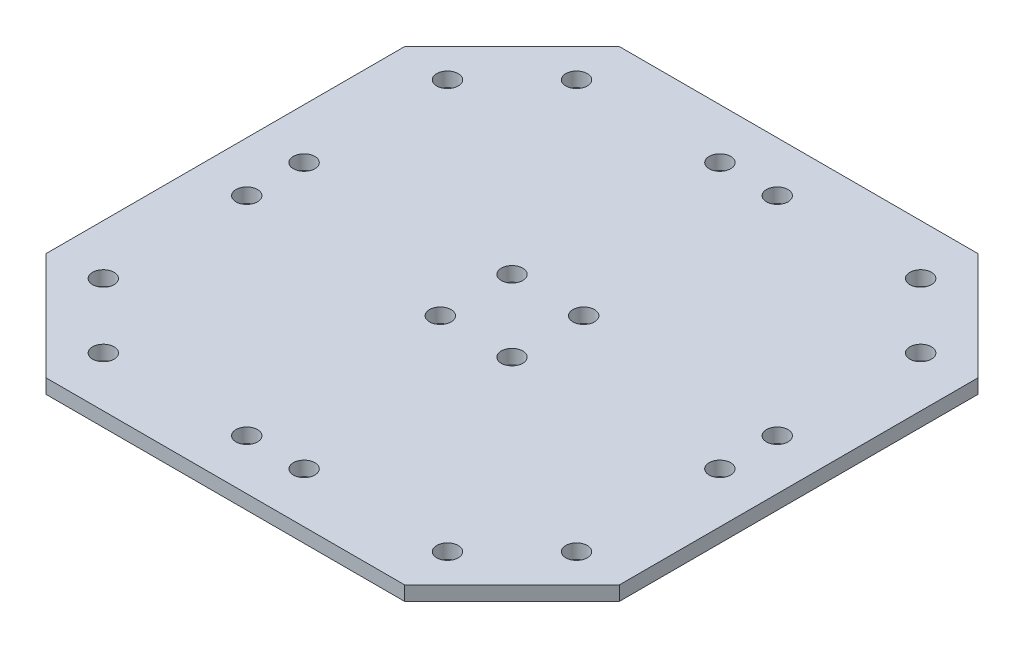
ISO-10303-21;
HEADER;
FILE_DESCRIPTION(('STEP AP214'),'2;1');
FILE_NAME('part.step','',(''),(''),'','','');
FILE_SCHEMA(('AUTOMOTIVE_DESIGN { 1 0 10303 214 1 1 1 1 }'));
ENDSEC;
DATA;
#1=APPLICATION_CONTEXT('core data for automotive mechanical design processes');
#2=APPLICATION_PROTOCOL_DEFINITION('international standard','automotive_design',2000,#1);
#3=PRODUCT_CONTEXT('',#1,'mechanical');
#4=PRODUCT('Part','Part','',(#3));
#5=PRODUCT_RELATED_PRODUCT_CATEGORY('part','',(#4));
#6=PRODUCT_DEFINITION_FORMATION('','',#4);
#7=PRODUCT_DEFINITION_CONTEXT('part definition',#1,'design');
#8=PRODUCT_DEFINITION('design','',#6,#7);
#9=PRODUCT_DEFINITION_SHAPE('','',#8);
#10=(LENGTH_UNIT() NAMED_UNIT(*) SI_UNIT(.MILLI.,.METRE.));
#11=(NAMED_UNIT(*) PLANE_ANGLE_UNIT() SI_UNIT($,.RADIAN.));
#12=(NAMED_UNIT(*) SI_UNIT($,.STERADIAN.) SOLID_ANGLE_UNIT());
#13=UNCERTAINTY_MEASURE_WITH_UNIT(LENGTH_MEASURE(1.E-05),#10,'distance_accuracy_value','');
#14=(GEOMETRIC_REPRESENTATION_CONTEXT(3) GLOBAL_UNCERTAINTY_ASSIGNED_CONTEXT((#13)) GLOBAL_UNIT_ASSIGNED_CONTEXT((#10,
#11,#12)) REPRESENTATION_CONTEXT('',''));
#15=CARTESIAN_POINT('',(0.,0.,0.));
#16=DIRECTION('',(0.,0.,1.));
#17=DIRECTION('',(1.,0.,0.));
#18=AXIS2_PLACEMENT_3D('',#15,#16,#17);
#19=CARTESIAN_POINT('',(32.5,2.,-32.5));
#20=DIRECTION('',(0.707106781186547,0.,-0.707106781186548));
#21=DIRECTION('',(-0.707106781186548,0.,-0.707106781186547));
#22=AXIS2_PLACEMENT_3D('',#19,#20,#21);
#23=PLANE('',#22);
#24=DIRECTION('',(0.707106781186548,0.,0.707106781186547));
#25=VECTOR('',#24,1.);
#26=CARTESIAN_POINT('',(32.5,0.,-32.5));
#27=LINE('',#26,#25);
#28=CARTESIAN_POINT('',(25.,0.,-40.));
#29=VERTEX_POINT('',#28);
#30=CARTESIAN_POINT('',(40.,0.,-25.));
#31=VERTEX_POINT('',#30);
#32=EDGE_CURVE('E152',#29,#31,#27,.T.);
#33=ORIENTED_EDGE('',*,*,#32,.F.);
#34=DIRECTION('',(0.,-1.,0.));
#35=VECTOR('',#34,1.);
#36=CARTESIAN_POINT('',(25.,2.,-40.));
#37=LINE('',#36,#35);
#38=CARTESIAN_POINT('',(25.,2.,-40.));
#39=VERTEX_POINT('',#38);
#40=EDGE_CURVE('E11',#39,#29,#37,.T.);
#41=ORIENTED_EDGE('',*,*,#40,.F.);
#42=DIRECTION('',(0.707106781186548,0.,0.707106781186547));
#43=VECTOR('',#42,1.);
#44=CARTESIAN_POINT('',(32.5,2.,-32.5));
#45=LINE('',#44,#43);
#46=CARTESIAN_POINT('',(40.,2.,-25.));
#47=VERTEX_POINT('',#46);
#48=EDGE_CURVE('E153',#39,#47,#45,.T.);
#49=ORIENTED_EDGE('',*,*,#48,.T.);
#50=DIRECTION('',(0.,-1.,0.));
#51=VECTOR('',#50,1.);
#52=CARTESIAN_POINT('',(40.,2.,-25.));
#53=LINE('',#52,#51);
#54=EDGE_CURVE('E49',#47,#31,#53,.T.);
#55=ORIENTED_EDGE('',*,*,#54,.T.);
#56=EDGE_LOOP('',(#33,#41,#49,#55));
#57=FACE_BOUND('',#56,.T.);
#58=ADVANCED_FACE('F41',(#57),#23,.T.);
#59=CARTESIAN_POINT('',(0.,2.,-40.));
#60=DIRECTION('',(0.,0.,-1.));
#61=DIRECTION('',(-1.,0.,0.));
#62=AXIS2_PLACEMENT_3D('',#59,#60,#61);
#63=PLANE('',#62);
#64=DIRECTION('',(1.,0.,0.));
#65=VECTOR('',#64,1.);
#66=CARTESIAN_POINT('',(0.,0.,-40.));
#67=LINE('',#66,#65);
#68=CARTESIAN_POINT('',(-25.,0.,-40.));
#69=VERTEX_POINT('',#68);
#70=EDGE_CURVE('E160',#69,#29,#67,.T.);
#71=ORIENTED_EDGE('',*,*,#70,.F.);
#72=DIRECTION('',(0.,-1.,0.));
#73=VECTOR('',#72,1.);
#74=CARTESIAN_POINT('',(-25.,2.,-40.));
#75=LINE('',#74,#73);
#76=CARTESIAN_POINT('',(-25.,2.,-40.));
#77=VERTEX_POINT('',#76);
#78=EDGE_CURVE('E116',#77,#69,#75,.T.);
#79=ORIENTED_EDGE('',*,*,#78,.F.);
#80=DIRECTION('',(1.,0.,0.));
#81=VECTOR('',#80,1.);
#82=CARTESIAN_POINT('',(0.,2.,-40.));
#83=LINE('',#82,#81);
#84=EDGE_CURVE('E156',#77,#39,#83,.T.);
#85=ORIENTED_EDGE('',*,*,#84,.T.);
#86=ORIENTED_EDGE('',*,*,#40,.T.);
#87=EDGE_LOOP('',(#71,#79,#85,#86));
#88=FACE_BOUND('',#87,.T.);
#89=ADVANCED_FACE('F173',(#88),#63,.T.);
#90=CARTESIAN_POINT('',(40.,2.,0.));
#91=DIRECTION('',(-1.,0.,0.));
#92=DIRECTION('',(0.,0.,1.));
#93=AXIS2_PLACEMENT_3D('',#90,#91,#92);
#94=PLANE('',#93);
#95=DIRECTION('',(0.,0.,-1.));
#96=VECTOR('',#95,1.);
#97=CARTESIAN_POINT('',(40.,0.,0.));
#98=LINE('',#97,#96);
#99=CARTESIAN_POINT('',(40.,0.,25.));
#100=VERTEX_POINT('',#99);
#101=EDGE_CURVE('E111',#100,#31,#98,.T.);
#102=ORIENTED_EDGE('',*,*,#101,.T.);
#103=ORIENTED_EDGE('',*,*,#54,.F.);
#104=DIRECTION('',(0.,0.,-1.));
#105=VECTOR('',#104,1.);
#106=CARTESIAN_POINT('',(40.,2.,0.));
#107=LINE('',#106,#105);
#108=CARTESIAN_POINT('',(40.,2.,25.));
#109=VERTEX_POINT('',#108);
#110=EDGE_CURVE('E57',#109,#47,#107,.T.);
#111=ORIENTED_EDGE('',*,*,#110,.F.);
#112=DIRECTION('',(0.,-1.,0.));
#113=VECTOR('',#112,1.);
#114=CARTESIAN_POINT('',(40.,2.,25.));
#115=LINE('',#114,#113);
#116=EDGE_CURVE('E106',#109,#100,#115,.T.);
#117=ORIENTED_EDGE('',*,*,#116,.T.);
#118=EDGE_LOOP('',(#102,#103,#111,#117));
#119=FACE_BOUND('',#118,.T.);
#120=ADVANCED_FACE('F165',(#119),#94,.F.);
#121=CARTESIAN_POINT('',(0.,2.,0.));
#122=DIRECTION('',(0.,1.,0.));
#123=DIRECTION('',(0.,0.,1.));
#124=AXIS2_PLACEMENT_3D('',#121,#122,#123);
#125=PLANE('',#124);
#126=CARTESIAN_POINT('',(-5.,2.,5.));
#127=DIRECTION('',(0.,1.,0.));
#128=DIRECTION('',(0.,0.,1.));
#129=AXIS2_PLACEMENT_3D('',#126,#127,#128);
#130=CIRCLE('',#129,1.5);
#131=CARTESIAN_POINT('',(-5.,2.,6.5));
#132=VERTEX_POINT('',#131);
#133=EDGE_CURVE('E594',#132,#132,#130,.T.);
#134=ORIENTED_EDGE('',*,*,#133,.F.);
#135=EDGE_LOOP('',(#134));
#136=FACE_BOUND('',#135,.T.);
#137=CARTESIAN_POINT('',(-33.,2.,4.));
#138=DIRECTION('',(0.,1.,0.));
#139=DIRECTION('',(0.,0.,1.));
#140=AXIS2_PLACEMENT_3D('',#137,#138,#139);
#141=CIRCLE('',#140,1.50000000000001);
#142=CARTESIAN_POINT('',(-33.,2.,5.50000000000001));
#143=VERTEX_POINT('',#142);
#144=EDGE_CURVE('E618',#143,#143,#141,.T.);
#145=ORIENTED_EDGE('',*,*,#144,.F.);
#146=EDGE_LOOP('',(#145));
#147=FACE_BOUND('',#146,.T.);
#148=CARTESIAN_POINT('',(-4.,2.,33.));
#149=DIRECTION('',(0.,1.,0.));
#150=DIRECTION('',(0.,0.,1.));
#151=AXIS2_PLACEMENT_3D('',#148,#149,#150);
#152=CIRCLE('',#151,1.5);
#153=CARTESIAN_POINT('',(-4.,2.,34.5));
#154=VERTEX_POINT('',#153);
#155=EDGE_CURVE('E615',#154,#154,#152,.T.);
#156=ORIENTED_EDGE('',*,*,#155,.F.);
#157=EDGE_LOOP('',(#156));
#158=FACE_BOUND('',#157,.T.);
#159=CARTESIAN_POINT('',(-24.,2.,33.));
#160=DIRECTION('',(0.,1.,0.));
#161=DIRECTION('',(0.,0.,1.));
#162=AXIS2_PLACEMENT_3D('',#159,#160,#161);
#163=CIRCLE('',#162,1.5);
#164=CARTESIAN_POINT('',(-24.,2.,34.5));
#165=VERTEX_POINT('',#164);
#166=EDGE_CURVE('E612',#165,#165,#163,.T.);
#167=ORIENTED_EDGE('',*,*,#166,.F.);
#168=EDGE_LOOP('',(#167));
#169=FACE_BOUND('',#168,.T.);
#170=CARTESIAN_POINT('',(-33.,2.,24.));
#171=DIRECTION('',(0.,1.,0.));
#172=DIRECTION('',(0.,0.,1.));
#173=AXIS2_PLACEMENT_3D('',#170,#171,#172);
#174=CIRCLE('',#173,1.50000000000001);
#175=CARTESIAN_POINT('',(-33.,2.,25.5));
#176=VERTEX_POINT('',#175);
#177=EDGE_CURVE('E608',#176,#176,#174,.T.);
#178=ORIENTED_EDGE('',*,*,#177,.F.);
#179=EDGE_LOOP('',(#178));
#180=FACE_BOUND('',#179,.T.);
#181=CARTESIAN_POINT('',(-5.,2.,-5.));
#182=DIRECTION('',(0.,1.,0.));
#183=DIRECTION('',(0.,0.,1.));
#184=AXIS2_PLACEMENT_3D('',#181,#182,#183);
#185=CIRCLE('',#184,1.5);
#186=CARTESIAN_POINT('',(-5.,2.,-3.5));
#187=VERTEX_POINT('',#186);
#188=EDGE_CURVE('E649',#187,#187,#185,.F.);
#189=ORIENTED_EDGE('',*,*,#188,.T.);
#190=EDGE_LOOP('',(#189));
#191=FACE_BOUND('',#190,.T.);
#192=CARTESIAN_POINT('',(-33.,2.,-4.));
#193=DIRECTION('',(0.,1.,0.));
#194=DIRECTION('',(0.,0.,1.));
#195=AXIS2_PLACEMENT_3D('',#192,#193,#194);
#196=CIRCLE('',#195,1.50000000000001);
#197=CARTESIAN_POINT('',(-33.,2.,-2.49999999999999));
#198=VERTEX_POINT('',#197);
#199=EDGE_CURVE('E646',#198,#198,#196,.F.);
#200=ORIENTED_EDGE('',*,*,#199,.T.);
#201=EDGE_LOOP('',(#200));
#202=FACE_BOUND('',#201,.T.);
#203=CARTESIAN_POINT('',(-4.,2.,-33.));
#204=DIRECTION('',(0.,1.,0.));
#205=DIRECTION('',(0.,0.,1.));
#206=AXIS2_PLACEMENT_3D('',#203,#204,#205);
#207=CIRCLE('',#206,1.5);
#208=CARTESIAN_POINT('',(-4.,2.,-31.5));
#209=VERTEX_POINT('',#208);
#210=EDGE_CURVE('E643',#209,#209,#207,.F.);
#211=ORIENTED_EDGE('',*,*,#210,.T.);
#212=EDGE_LOOP('',(#211));
#213=FACE_BOUND('',#212,.T.);
#214=CARTESIAN_POINT('',(-24.,2.,-33.));
#215=DIRECTION('',(0.,1.,0.));
#216=DIRECTION('',(0.,0.,1.));
#217=AXIS2_PLACEMENT_3D('',#214,#215,#216);
#218=CIRCLE('',#217,1.5);
#219=CARTESIAN_POINT('',(-24.,2.,-31.5));
#220=VERTEX_POINT('',#219);
#221=EDGE_CURVE('E640',#220,#220,#218,.F.);
#222=ORIENTED_EDGE('',*,*,#221,.T.);
#223=EDGE_LOOP('',(#222));
#224=FACE_BOUND('',#223,.T.);
#225=CARTESIAN_POINT('',(-33.,2.,-24.));
#226=DIRECTION('',(0.,1.,0.));
#227=DIRECTION('',(0.,0.,1.));
#228=AXIS2_PLACEMENT_3D('',#225,#226,#227);
#229=CIRCLE('',#228,1.50000000000001);
#230=CARTESIAN_POINT('',(-33.,2.,-22.5));
#231=VERTEX_POINT('',#230);
#232=EDGE_CURVE('E637',#231,#231,#229,.F.);
#233=ORIENTED_EDGE('',*,*,#232,.T.);
#234=EDGE_LOOP('',(#233));
#235=FACE_BOUND('',#234,.T.);
#236=CARTESIAN_POINT('',(5.,2.,5.));
#237=DIRECTION('',(0.,1.,0.));
#238=DIRECTION('',(0.,0.,1.));
#239=AXIS2_PLACEMENT_3D('',#236,#237,#238);
#240=CIRCLE('',#239,1.5);
#241=CARTESIAN_POINT('',(5.,2.,6.5));
#242=VERTEX_POINT('',#241);
#243=EDGE_CURVE('E679',#242,#242,#240,.F.);
#244=ORIENTED_EDGE('',*,*,#243,.T.);
#245=EDGE_LOOP('',(#244));
#246=FACE_BOUND('',#245,.T.);
#247=CARTESIAN_POINT('',(33.,2.,4.));
#248=DIRECTION('',(0.,1.,0.));
#249=DIRECTION('',(0.,0.,1.));
#250=AXIS2_PLACEMENT_3D('',#247,#248,#249);
#251=CIRCLE('',#250,1.50000000000001);
#252=CARTESIAN_POINT('',(33.,2.,5.50000000000001));
#253=VERTEX_POINT('',#252);
#254=EDGE_CURVE('E676',#253,#253,#251,.F.);
#255=ORIENTED_EDGE('',*,*,#254,.T.);
#256=EDGE_LOOP('',(#255));
#257=FACE_BOUND('',#256,.T.);
#258=CARTESIAN_POINT('',(4.,2.,33.));
#259=DIRECTION('',(0.,1.,0.));
#260=DIRECTION('',(0.,0.,1.));
#261=AXIS2_PLACEMENT_3D('',#258,#259,#260);
#262=CIRCLE('',#261,1.5);
#263=CARTESIAN_POINT('',(4.,2.,34.5));
#264=VERTEX_POINT('',#263);
#265=EDGE_CURVE('E673',#264,#264,#262,.F.);
#266=ORIENTED_EDGE('',*,*,#265,.T.);
#267=EDGE_LOOP('',(#266));
#268=FACE_BOUND('',#267,.T.);
#269=CARTESIAN_POINT('',(24.,2.,33.));
#270=DIRECTION('',(0.,1.,0.));
#271=DIRECTION('',(0.,0.,1.));
#272=AXIS2_PLACEMENT_3D('',#269,#270,#271);
#273=CIRCLE('',#272,1.5);
#274=CARTESIAN_POINT('',(24.,2.,34.5));
#275=VERTEX_POINT('',#274);
#276=EDGE_CURVE('E670',#275,#275,#273,.F.);
#277=ORIENTED_EDGE('',*,*,#276,.T.);
#278=EDGE_LOOP('',(#277));
#279=FACE_BOUND('',#278,.T.);
#280=CARTESIAN_POINT('',(33.,2.,24.));
#281=DIRECTION('',(0.,1.,0.));
#282=DIRECTION('',(0.,0.,1.));
#283=AXIS2_PLACEMENT_3D('',#280,#281,#282);
#284=CIRCLE('',#283,1.50000000000001);
#285=CARTESIAN_POINT('',(33.,2.,25.5));
#286=VERTEX_POINT('',#285);
#287=EDGE_CURVE('E667',#286,#286,#284,.F.);
#288=ORIENTED_EDGE('',*,*,#287,.T.);
#289=EDGE_LOOP('',(#288));
#290=FACE_BOUND('',#289,.T.);
#291=CARTESIAN_POINT('',(5.,2.,-5.));
#292=DIRECTION('',(0.,1.,0.));
#293=DIRECTION('',(0.,0.,1.));
#294=AXIS2_PLACEMENT_3D('',#291,#292,#293);
#295=CIRCLE('',#294,1.5);
#296=CARTESIAN_POINT('',(5.,2.,-3.5));
#297=VERTEX_POINT('',#296);
#298=EDGE_CURVE('E149',#297,#297,#295,.T.);
#299=ORIENTED_EDGE('',*,*,#298,.F.);
#300=EDGE_LOOP('',(#299));
#301=FACE_BOUND('',#300,.T.);
#302=CARTESIAN_POINT('',(33.,2.,-4.));
#303=DIRECTION('',(0.,1.,0.));
#304=DIRECTION('',(0.,0.,1.));
#305=AXIS2_PLACEMENT_3D('',#302,#303,#304);
#306=CIRCLE('',#305,1.50000000000001);
#307=CARTESIAN_POINT('',(33.,2.,-2.49999999999999));
#308=VERTEX_POINT('',#307);
#309=EDGE_CURVE('E146',#308,#308,#306,.T.);
#310=ORIENTED_EDGE('',*,*,#309,.F.);
#311=EDGE_LOOP('',(#310));
#312=FACE_BOUND('',#311,.T.);
#313=CARTESIAN_POINT('',(4.,2.,-33.));
#314=DIRECTION('',(0.,1.,0.));
#315=DIRECTION('',(0.,0.,1.));
#316=AXIS2_PLACEMENT_3D('',#313,#314,#315);
#317=CIRCLE('',#316,1.5);
#318=CARTESIAN_POINT('',(4.,2.,-31.5));
#319=VERTEX_POINT('',#318);
#320=EDGE_CURVE('E143',#319,#319,#317,.T.);
#321=ORIENTED_EDGE('',*,*,#320,.F.);
#322=EDGE_LOOP('',(#321));
#323=FACE_BOUND('',#322,.T.);
#324=CARTESIAN_POINT('',(24.,2.,-33.));
#325=DIRECTION('',(0.,1.,0.));
#326=DIRECTION('',(0.,0.,1.));
#327=AXIS2_PLACEMENT_3D('',#324,#325,#326);
#328=CIRCLE('',#327,1.5);
#329=CARTESIAN_POINT('',(24.,2.,-31.5));
#330=VERTEX_POINT('',#329);
#331=EDGE_CURVE('E140',#330,#330,#328,.T.);
#332=ORIENTED_EDGE('',*,*,#331,.F.);
#333=EDGE_LOOP('',(#332));
#334=FACE_BOUND('',#333,.T.);
#335=CARTESIAN_POINT('',(33.,2.,-24.));
#336=DIRECTION('',(0.,1.,0.));
#337=DIRECTION('',(0.,0.,1.));
#338=AXIS2_PLACEMENT_3D('',#335,#336,#337);
#339=CIRCLE('',#338,1.50000000000001);
#340=CARTESIAN_POINT('',(33.,2.,-22.5));
#341=VERTEX_POINT('',#340);
#342=EDGE_CURVE('E137',#341,#341,#339,.T.);
#343=ORIENTED_EDGE('',*,*,#342,.F.);
#344=EDGE_LOOP('',(#343));
#345=FACE_BOUND('',#344,.T.);
#346=ORIENTED_EDGE('',*,*,#48,.F.);
#347=ORIENTED_EDGE('',*,*,#84,.F.);
#348=DIRECTION('',(-0.707106781186548,0.,0.707106781186547));
#349=VECTOR('',#348,1.);
#350=CARTESIAN_POINT('',(-32.5,2.,-32.5));
#351=LINE('',#350,#349);
#352=CARTESIAN_POINT('',(-40.,2.,-25.));
#353=VERTEX_POINT('',#352);
#354=EDGE_CURVE('E181',#77,#353,#351,.T.);
#355=ORIENTED_EDGE('',*,*,#354,.T.);
#356=DIRECTION('',(0.,0.,-1.));
#357=VECTOR('',#356,1.);
#358=CARTESIAN_POINT('',(-40.,2.,0.));
#359=LINE('',#358,#357);
#360=CARTESIAN_POINT('',(-40.,2.,25.));
#361=VERTEX_POINT('',#360);
#362=EDGE_CURVE('E182',#361,#353,#359,.T.);
#363=ORIENTED_EDGE('',*,*,#362,.F.);
#364=DIRECTION('',(-0.707106781186548,0.,-0.707106781186547));
#365=VECTOR('',#364,1.);
#366=CARTESIAN_POINT('',(-32.5,2.,32.5));
#367=LINE('',#366,#365);
#368=CARTESIAN_POINT('',(-25.,2.,40.));
#369=VERTEX_POINT('',#368);
#370=EDGE_CURVE('E683',#369,#361,#367,.T.);
#371=ORIENTED_EDGE('',*,*,#370,.F.);
#372=DIRECTION('',(1.,0.,0.));
#373=VECTOR('',#372,1.);
#374=CARTESIAN_POINT('',(0.,2.,40.));
#375=LINE('',#374,#373);
#376=CARTESIAN_POINT('',(25.,2.,40.));
#377=VERTEX_POINT('',#376);
#378=EDGE_CURVE('E74',#369,#377,#375,.T.);
#379=ORIENTED_EDGE('',*,*,#378,.T.);
#380=DIRECTION('',(0.707106781186548,0.,-0.707106781186547));
#381=VECTOR('',#380,1.);
#382=CARTESIAN_POINT('',(32.5,2.,32.5));
#383=LINE('',#382,#381);
#384=EDGE_CURVE('E99',#377,#109,#383,.T.);
#385=ORIENTED_EDGE('',*,*,#384,.T.);
#386=ORIENTED_EDGE('',*,*,#110,.T.);
#387=EDGE_LOOP('',(#346,#347,#355,#363,#371,#379,#385,#386));
#388=FACE_BOUND('',#387,.T.);
#389=ADVANCED_FACE('F189',(#136,#147,#158,#169,#180,#191,#202,#213,#224,#235,#246,#257,#268,
#279,#290,#301,#312,#323,#334,#345,#388),#125,.T.);
#390=CARTESIAN_POINT('',(0.,0.,0.));
#391=DIRECTION('',(0.,1.,0.));
#392=DIRECTION('',(0.,0.,1.));
#393=AXIS2_PLACEMENT_3D('',#390,#391,#392);
#394=PLANE('',#393);
#395=CARTESIAN_POINT('',(-5.,0.,5.));
#396=DIRECTION('',(0.,1.,0.));
#397=DIRECTION('',(0.,0.,-1.));
#398=AXIS2_PLACEMENT_3D('',#395,#396,#397);
#399=CIRCLE('',#398,1.5);
#400=CARTESIAN_POINT('',(-5.,0.,3.5));
#401=VERTEX_POINT('',#400);
#402=EDGE_CURVE('E597',#401,#401,#399,.T.);
#403=ORIENTED_EDGE('',*,*,#402,.T.);
#404=EDGE_LOOP('',(#403));
#405=FACE_BOUND('',#404,.T.);
#406=CARTESIAN_POINT('',(-33.,0.,4.));
#407=DIRECTION('',(0.,1.,0.));
#408=DIRECTION('',(0.,0.,-1.));
#409=AXIS2_PLACEMENT_3D('',#406,#407,#408);
#410=CIRCLE('',#409,1.50000000000001);
#411=CARTESIAN_POINT('',(-33.,0.,2.49999999999999));
#412=VERTEX_POINT('',#411);
#413=EDGE_CURVE('E598',#412,#412,#410,.T.);
#414=ORIENTED_EDGE('',*,*,#413,.T.);
#415=EDGE_LOOP('',(#414));
#416=FACE_BOUND('',#415,.T.);
#417=CARTESIAN_POINT('',(-4.,0.,33.));
#418=DIRECTION('',(0.,1.,0.));
#419=DIRECTION('',(0.,0.,-1.));
#420=AXIS2_PLACEMENT_3D('',#417,#418,#419);
#421=CIRCLE('',#420,1.5);
#422=CARTESIAN_POINT('',(-4.,0.,31.5));
#423=VERTEX_POINT('',#422);
#424=EDGE_CURVE('E601',#423,#423,#421,.T.);
#425=ORIENTED_EDGE('',*,*,#424,.T.);
#426=EDGE_LOOP('',(#425));
#427=FACE_BOUND('',#426,.T.);
#428=CARTESIAN_POINT('',(-24.,0.,33.));
#429=DIRECTION('',(0.,1.,0.));
#430=DIRECTION('',(0.,0.,-1.));
#431=AXIS2_PLACEMENT_3D('',#428,#429,#430);
#432=CIRCLE('',#431,1.5);
#433=CARTESIAN_POINT('',(-24.,0.,31.5));
#434=VERTEX_POINT('',#433);
#435=EDGE_CURVE('E609',#434,#434,#432,.T.);
#436=ORIENTED_EDGE('',*,*,#435,.T.);
#437=EDGE_LOOP('',(#436));
#438=FACE_BOUND('',#437,.T.);
#439=CARTESIAN_POINT('',(-33.,0.,24.));
#440=DIRECTION('',(0.,1.,0.));
#441=DIRECTION('',(0.,0.,-1.));
#442=AXIS2_PLACEMENT_3D('',#439,#440,#441);
#443=CIRCLE('',#442,1.50000000000001);
#444=CARTESIAN_POINT('',(-33.,0.,22.5));
#445=VERTEX_POINT('',#444);
#446=EDGE_CURVE('E605',#445,#445,#443,.T.);
#447=ORIENTED_EDGE('',*,*,#446,.T.);
#448=EDGE_LOOP('',(#447));
#449=FACE_BOUND('',#448,.T.);
#450=CARTESIAN_POINT('',(-5.,0.,-5.));
#451=DIRECTION('',(0.,-1.,0.));
#452=DIRECTION('',(0.,0.,1.));
#453=AXIS2_PLACEMENT_3D('',#450,#451,#452);
#454=CIRCLE('',#453,1.5);
#455=CARTESIAN_POINT('',(-5.,0.,-3.5));
#456=VERTEX_POINT('',#455);
#457=EDGE_CURVE('E622',#456,#456,#454,.T.);
#458=ORIENTED_EDGE('',*,*,#457,.F.);
#459=EDGE_LOOP('',(#458));
#460=FACE_BOUND('',#459,.T.);
#461=CARTESIAN_POINT('',(-33.,0.,-4.));
#462=DIRECTION('',(0.,-1.,0.));
#463=DIRECTION('',(0.,0.,1.));
#464=AXIS2_PLACEMENT_3D('',#461,#462,#463);
#465=CIRCLE('',#464,1.50000000000001);
#466=CARTESIAN_POINT('',(-33.,0.,-2.49999999999999));
#467=VERTEX_POINT('',#466);
#468=EDGE_CURVE('E630',#467,#467,#465,.T.);
#469=ORIENTED_EDGE('',*,*,#468,.F.);
#470=EDGE_LOOP('',(#469));
#471=FACE_BOUND('',#470,.T.);
#472=CARTESIAN_POINT('',(-4.,0.,-33.));
#473=DIRECTION('',(0.,-1.,0.));
#474=DIRECTION('',(0.,0.,1.));
#475=AXIS2_PLACEMENT_3D('',#472,#473,#474);
#476=CIRCLE('',#475,1.5);
#477=CARTESIAN_POINT('',(-4.,0.,-31.5));
#478=VERTEX_POINT('',#477);
#479=EDGE_CURVE('E627',#478,#478,#476,.T.);
#480=ORIENTED_EDGE('',*,*,#479,.F.);
#481=EDGE_LOOP('',(#480));
#482=FACE_BOUND('',#481,.T.);
#483=CARTESIAN_POINT('',(-24.,0.,-33.));
#484=DIRECTION('',(0.,-1.,0.));
#485=DIRECTION('',(0.,0.,1.));
#486=AXIS2_PLACEMENT_3D('',#483,#484,#485);
#487=CIRCLE('',#486,1.5);
#488=CARTESIAN_POINT('',(-24.,0.,-31.5));
#489=VERTEX_POINT('',#488);
#490=EDGE_CURVE('E623',#489,#489,#487,.T.);
#491=ORIENTED_EDGE('',*,*,#490,.F.);
#492=EDGE_LOOP('',(#491));
#493=FACE_BOUND('',#492,.T.);
#494=CARTESIAN_POINT('',(-33.,0.,-24.));
#495=DIRECTION('',(0.,-1.,0.));
#496=DIRECTION('',(0.,0.,1.));
#497=AXIS2_PLACEMENT_3D('',#494,#495,#496);
#498=CIRCLE('',#497,1.50000000000001);
#499=CARTESIAN_POINT('',(-33.,0.,-22.5));
#500=VERTEX_POINT('',#499);
#501=EDGE_CURVE('E626',#500,#500,#498,.T.);
#502=ORIENTED_EDGE('',*,*,#501,.F.);
#503=EDGE_LOOP('',(#502));
#504=FACE_BOUND('',#503,.T.);
#505=CARTESIAN_POINT('',(5.,0.,5.));
#506=DIRECTION('',(0.,-1.,0.));
#507=DIRECTION('',(0.,0.,-1.));
#508=AXIS2_PLACEMENT_3D('',#505,#506,#507);
#509=CIRCLE('',#508,1.5);
#510=CARTESIAN_POINT('',(5.,0.,3.5));
#511=VERTEX_POINT('',#510);
#512=EDGE_CURVE('E652',#511,#511,#509,.T.);
#513=ORIENTED_EDGE('',*,*,#512,.F.);
#514=EDGE_LOOP('',(#513));
#515=FACE_BOUND('',#514,.T.);
#516=CARTESIAN_POINT('',(33.,0.,4.));
#517=DIRECTION('',(0.,-1.,0.));
#518=DIRECTION('',(0.,0.,-1.));
#519=AXIS2_PLACEMENT_3D('',#516,#517,#518);
#520=CIRCLE('',#519,1.50000000000001);
#521=CARTESIAN_POINT('',(33.,0.,2.49999999999999));
#522=VERTEX_POINT('',#521);
#523=EDGE_CURVE('E660',#522,#522,#520,.T.);
#524=ORIENTED_EDGE('',*,*,#523,.F.);
#525=EDGE_LOOP('',(#524));
#526=FACE_BOUND('',#525,.T.);
#527=CARTESIAN_POINT('',(4.,0.,33.));
#528=DIRECTION('',(0.,-1.,0.));
#529=DIRECTION('',(0.,0.,-1.));
#530=AXIS2_PLACEMENT_3D('',#527,#528,#529);
#531=CIRCLE('',#530,1.5);
#532=CARTESIAN_POINT('',(4.,0.,31.5));
#533=VERTEX_POINT('',#532);
#534=EDGE_CURVE('E657',#533,#533,#531,.T.);
#535=ORIENTED_EDGE('',*,*,#534,.F.);
#536=EDGE_LOOP('',(#535));
#537=FACE_BOUND('',#536,.T.);
#538=CARTESIAN_POINT('',(24.,0.,33.));
#539=DIRECTION('',(0.,-1.,0.));
#540=DIRECTION('',(0.,0.,-1.));
#541=AXIS2_PLACEMENT_3D('',#538,#539,#540);
#542=CIRCLE('',#541,1.5);
#543=CARTESIAN_POINT('',(24.,0.,31.5));
#544=VERTEX_POINT('',#543);
#545=EDGE_CURVE('E653',#544,#544,#542,.T.);
#546=ORIENTED_EDGE('',*,*,#545,.F.);
#547=EDGE_LOOP('',(#546));
#548=FACE_BOUND('',#547,.T.);
#549=CARTESIAN_POINT('',(33.,0.,24.));
#550=DIRECTION('',(0.,-1.,0.));
#551=DIRECTION('',(0.,0.,-1.));
#552=AXIS2_PLACEMENT_3D('',#549,#550,#551);
#553=CIRCLE('',#552,1.50000000000001);
#554=CARTESIAN_POINT('',(33.,0.,22.5));
#555=VERTEX_POINT('',#554);
#556=EDGE_CURVE('E656',#555,#555,#553,.T.);
#557=ORIENTED_EDGE('',*,*,#556,.F.);
#558=EDGE_LOOP('',(#557));
#559=FACE_BOUND('',#558,.T.);
#560=CARTESIAN_POINT('',(5.,0.,-5.));
#561=DIRECTION('',(0.,1.,0.));
#562=DIRECTION('',(0.,0.,1.));
#563=AXIS2_PLACEMENT_3D('',#560,#561,#562);
#564=CIRCLE('',#563,1.5);
#565=CARTESIAN_POINT('',(5.,0.,-3.5));
#566=VERTEX_POINT('',#565);
#567=EDGE_CURVE('E122',#566,#566,#564,.T.);
#568=ORIENTED_EDGE('',*,*,#567,.T.);
#569=EDGE_LOOP('',(#568));
#570=FACE_BOUND('',#569,.T.);
#571=CARTESIAN_POINT('',(33.,0.,-4.));
#572=DIRECTION('',(0.,1.,0.));
#573=DIRECTION('',(0.,0.,1.));
#574=AXIS2_PLACEMENT_3D('',#571,#572,#573);
#575=CIRCLE('',#574,1.50000000000001);
#576=CARTESIAN_POINT('',(33.,0.,-2.49999999999999));
#577=VERTEX_POINT('',#576);
#578=EDGE_CURVE('E130',#577,#577,#575,.T.);
#579=ORIENTED_EDGE('',*,*,#578,.T.);
#580=EDGE_LOOP('',(#579));
#581=FACE_BOUND('',#580,.T.);
#582=CARTESIAN_POINT('',(4.,0.,-33.));
#583=DIRECTION('',(0.,1.,0.));
#584=DIRECTION('',(0.,0.,1.));
#585=AXIS2_PLACEMENT_3D('',#582,#583,#584);
#586=CIRCLE('',#585,1.5);
#587=CARTESIAN_POINT('',(4.,0.,-31.5));
#588=VERTEX_POINT('',#587);
#589=EDGE_CURVE('E127',#588,#588,#586,.T.);
#590=ORIENTED_EDGE('',*,*,#589,.T.);
#591=EDGE_LOOP('',(#590));
#592=FACE_BOUND('',#591,.T.);
#593=CARTESIAN_POINT('',(24.,0.,-33.));
#594=DIRECTION('',(0.,1.,0.));
#595=DIRECTION('',(0.,0.,1.));
#596=AXIS2_PLACEMENT_3D('',#593,#594,#595);
#597=CIRCLE('',#596,1.5);
#598=CARTESIAN_POINT('',(24.,0.,-31.5));
#599=VERTEX_POINT('',#598);
#600=EDGE_CURVE('E123',#599,#599,#597,.T.);
#601=ORIENTED_EDGE('',*,*,#600,.T.);
#602=EDGE_LOOP('',(#601));
#603=FACE_BOUND('',#602,.T.);
#604=CARTESIAN_POINT('',(33.,0.,-24.));
#605=DIRECTION('',(0.,1.,0.));
#606=DIRECTION('',(0.,0.,1.));
#607=AXIS2_PLACEMENT_3D('',#604,#605,#606);
#608=CIRCLE('',#607,1.50000000000001);
#609=CARTESIAN_POINT('',(33.,0.,-22.5));
#610=VERTEX_POINT('',#609);
#611=EDGE_CURVE('E126',#610,#610,#608,.T.);
#612=ORIENTED_EDGE('',*,*,#611,.T.);
#613=EDGE_LOOP('',(#612));
#614=FACE_BOUND('',#613,.T.);
#615=ORIENTED_EDGE('',*,*,#32,.T.);
#616=ORIENTED_EDGE('',*,*,#101,.F.);
#617=DIRECTION('',(0.707106781186548,0.,-0.707106781186547));
#618=VECTOR('',#617,1.);
#619=CARTESIAN_POINT('',(32.5,0.,32.5));
#620=LINE('',#619,#618);
#621=CARTESIAN_POINT('',(25.,0.,40.));
#622=VERTEX_POINT('',#621);
#623=EDGE_CURVE('E100',#622,#100,#620,.T.);
#624=ORIENTED_EDGE('',*,*,#623,.F.);
#625=DIRECTION('',(1.,0.,0.));
#626=VECTOR('',#625,1.);
#627=CARTESIAN_POINT('',(0.,0.,40.));
#628=LINE('',#627,#626);
#629=CARTESIAN_POINT('',(-25.,0.,40.));
#630=VERTEX_POINT('',#629);
#631=EDGE_CURVE('E87',#630,#622,#628,.T.);
#632=ORIENTED_EDGE('',*,*,#631,.F.);
#633=DIRECTION('',(-0.707106781186548,0.,-0.707106781186547));
#634=VECTOR('',#633,1.);
#635=CARTESIAN_POINT('',(-32.5,0.,32.5));
#636=LINE('',#635,#634);
#637=CARTESIAN_POINT('',(-40.,0.,25.));
#638=VERTEX_POINT('',#637);
#639=EDGE_CURVE('E682',#630,#638,#636,.T.);
#640=ORIENTED_EDGE('',*,*,#639,.T.);
#641=DIRECTION('',(0.,0.,-1.));
#642=VECTOR('',#641,1.);
#643=CARTESIAN_POINT('',(-40.,0.,0.));
#644=LINE('',#643,#642);
#645=CARTESIAN_POINT('',(-40.,0.,-25.));
#646=VERTEX_POINT('',#645);
#647=EDGE_CURVE('E187',#638,#646,#644,.T.);
#648=ORIENTED_EDGE('',*,*,#647,.T.);
#649=DIRECTION('',(-0.707106781186548,0.,0.707106781186547));
#650=VECTOR('',#649,1.);
#651=CARTESIAN_POINT('',(-32.5,0.,-32.5));
#652=LINE('',#651,#650);
#653=EDGE_CURVE('E170',#69,#646,#652,.T.);
#654=ORIENTED_EDGE('',*,*,#653,.F.);
#655=ORIENTED_EDGE('',*,*,#70,.T.);
#656=EDGE_LOOP('',(#615,#616,#624,#632,#640,#648,#654,#655));
#657=FACE_BOUND('',#656,.T.);
#658=ADVANCED_FACE('F109',(#405,#416,#427,#438,#449,#460,#471,#482,#493,#504,#515,#526,#537,
#548,#559,#570,#581,#592,#603,#614,#657),#394,.F.);
#659=CARTESIAN_POINT('',(33.,0.,-24.));
#660=DIRECTION('',(0.,1.,0.));
#661=DIRECTION('',(0.,0.,1.));
#662=AXIS2_PLACEMENT_3D('',#659,#660,#661);
#663=CYLINDRICAL_SURFACE('',#662,1.50000000000001);
#664=ORIENTED_EDGE('',*,*,#342,.T.);
#665=EDGE_LOOP('',(#664));
#666=FACE_BOUND('',#665,.T.);
#667=ORIENTED_EDGE('',*,*,#611,.F.);
#668=EDGE_LOOP('',(#667));
#669=FACE_BOUND('',#668,.T.);
#670=ADVANCED_FACE('F198',(#666,#669),#663,.F.);
#671=CARTESIAN_POINT('',(24.,0.,-33.));
#672=DIRECTION('',(0.,1.,0.));
#673=DIRECTION('',(0.,0.,1.));
#674=AXIS2_PLACEMENT_3D('',#671,#672,#673);
#675=CYLINDRICAL_SURFACE('',#674,1.5);
#676=ORIENTED_EDGE('',*,*,#331,.T.);
#677=EDGE_LOOP('',(#676));
#678=FACE_BOUND('',#677,.T.);
#679=ORIENTED_EDGE('',*,*,#600,.F.);
#680=EDGE_LOOP('',(#679));
#681=FACE_BOUND('',#680,.T.);
#682=ADVANCED_FACE('F501',(#678,#681),#675,.F.);
#683=CARTESIAN_POINT('',(4.,0.,-33.));
#684=DIRECTION('',(0.,1.,0.));
#685=DIRECTION('',(0.,0.,1.));
#686=AXIS2_PLACEMENT_3D('',#683,#684,#685);
#687=CYLINDRICAL_SURFACE('',#686,1.5);
#688=ORIENTED_EDGE('',*,*,#320,.T.);
#689=EDGE_LOOP('',(#688));
#690=FACE_BOUND('',#689,.T.);
#691=ORIENTED_EDGE('',*,*,#589,.F.);
#692=EDGE_LOOP('',(#691));
#693=FACE_BOUND('',#692,.T.);
#694=ADVANCED_FACE('F491',(#690,#693),#687,.F.);
#695=CARTESIAN_POINT('',(33.,0.,-4.));
#696=DIRECTION('',(0.,1.,0.));
#697=DIRECTION('',(0.,0.,1.));
#698=AXIS2_PLACEMENT_3D('',#695,#696,#697);
#699=CYLINDRICAL_SURFACE('',#698,1.50000000000001);
#700=ORIENTED_EDGE('',*,*,#309,.T.);
#701=EDGE_LOOP('',(#700));
#702=FACE_BOUND('',#701,.T.);
#703=ORIENTED_EDGE('',*,*,#578,.F.);
#704=EDGE_LOOP('',(#703));
#705=FACE_BOUND('',#704,.T.);
#706=ADVANCED_FACE('F482',(#702,#705),#699,.F.);
#707=CARTESIAN_POINT('',(5.,0.,-5.));
#708=DIRECTION('',(0.,1.,0.));
#709=DIRECTION('',(0.,0.,1.));
#710=AXIS2_PLACEMENT_3D('',#707,#708,#709);
#711=CYLINDRICAL_SURFACE('',#710,1.5);
#712=ORIENTED_EDGE('',*,*,#298,.T.);
#713=EDGE_LOOP('',(#712));
#714=FACE_BOUND('',#713,.T.);
#715=ORIENTED_EDGE('',*,*,#567,.F.);
#716=EDGE_LOOP('',(#715));
#717=FACE_BOUND('',#716,.T.);
#718=ADVANCED_FACE('F241',(#714,#717),#711,.F.);
#719=CARTESIAN_POINT('',(32.5,2.,32.5));
#720=DIRECTION('',(-0.707106781186547,0.,-0.707106781186548));
#721=DIRECTION('',(-0.707106781186548,0.,0.707106781186547));
#722=AXIS2_PLACEMENT_3D('',#719,#720,#721);
#723=PLANE('',#722);
#724=ORIENTED_EDGE('',*,*,#623,.T.);
#725=ORIENTED_EDGE('',*,*,#116,.F.);
#726=ORIENTED_EDGE('',*,*,#384,.F.);
#727=DIRECTION('',(0.,-1.,0.));
#728=VECTOR('',#727,1.);
#729=CARTESIAN_POINT('',(25.,2.,40.));
#730=LINE('',#729,#728);
#731=EDGE_CURVE('E90',#377,#622,#730,.T.);
#732=ORIENTED_EDGE('',*,*,#731,.T.);
#733=EDGE_LOOP('',(#724,#725,#726,#732));
#734=FACE_BOUND('',#733,.T.);
#735=ADVANCED_FACE('F104',(#734),#723,.F.);
#736=CARTESIAN_POINT('',(0.,2.,40.));
#737=DIRECTION('',(0.,0.,-1.));
#738=DIRECTION('',(-1.,0.,0.));
#739=AXIS2_PLACEMENT_3D('',#736,#737,#738);
#740=PLANE('',#739);
#741=ORIENTED_EDGE('',*,*,#631,.T.);
#742=ORIENTED_EDGE('',*,*,#731,.F.);
#743=ORIENTED_EDGE('',*,*,#378,.F.);
#744=DIRECTION('',(0.,-1.,0.));
#745=VECTOR('',#744,1.);
#746=CARTESIAN_POINT('',(-25.,2.,40.));
#747=LINE('',#746,#745);
#748=EDGE_CURVE('E94',#369,#630,#747,.T.);
#749=ORIENTED_EDGE('',*,*,#748,.T.);
#750=EDGE_LOOP('',(#741,#742,#743,#749));
#751=FACE_BOUND('',#750,.T.);
#752=ADVANCED_FACE('F89',(#751),#740,.F.);
#753=CARTESIAN_POINT('',(-32.5,2.,-32.5));
#754=DIRECTION('',(0.707106781186547,0.,0.707106781186548));
#755=DIRECTION('',(0.707106781186548,0.,-0.707106781186547));
#756=AXIS2_PLACEMENT_3D('',#753,#754,#755);
#757=PLANE('',#756);
#758=ORIENTED_EDGE('',*,*,#653,.T.);
#759=DIRECTION('',(0.,-1.,0.));
#760=VECTOR('',#759,1.);
#761=CARTESIAN_POINT('',(-40.,2.,-25.));
#762=LINE('',#761,#760);
#763=EDGE_CURVE('E113',#353,#646,#762,.T.);
#764=ORIENTED_EDGE('',*,*,#763,.F.);
#765=ORIENTED_EDGE('',*,*,#354,.F.);
#766=ORIENTED_EDGE('',*,*,#78,.T.);
#767=EDGE_LOOP('',(#758,#764,#765,#766));
#768=FACE_BOUND('',#767,.T.);
#769=ADVANCED_FACE('F178',(#768),#757,.F.);
#770=CARTESIAN_POINT('',(-40.,2.,0.));
#771=DIRECTION('',(-1.,0.,0.));
#772=DIRECTION('',(0.,0.,1.));
#773=AXIS2_PLACEMENT_3D('',#770,#771,#772);
#774=PLANE('',#773);
#775=ORIENTED_EDGE('',*,*,#647,.F.);
#776=DIRECTION('',(0.,-1.,0.));
#777=VECTOR('',#776,1.);
#778=CARTESIAN_POINT('',(-40.,2.,25.));
#779=LINE('',#778,#777);
#780=EDGE_CURVE('E686',#361,#638,#779,.T.);
#781=ORIENTED_EDGE('',*,*,#780,.F.);
#782=ORIENTED_EDGE('',*,*,#362,.T.);
#783=ORIENTED_EDGE('',*,*,#763,.T.);
#784=EDGE_LOOP('',(#775,#781,#782,#783));
#785=FACE_BOUND('',#784,.T.);
#786=ADVANCED_FACE('F261',(#785),#774,.T.);
#787=CARTESIAN_POINT('',(-32.5,2.,32.5));
#788=DIRECTION('',(-0.707106781186547,0.,0.707106781186548));
#789=DIRECTION('',(0.707106781186548,0.,0.707106781186547));
#790=AXIS2_PLACEMENT_3D('',#787,#788,#789);
#791=PLANE('',#790);
#792=ORIENTED_EDGE('',*,*,#639,.F.);
#793=ORIENTED_EDGE('',*,*,#748,.F.);
#794=ORIENTED_EDGE('',*,*,#370,.T.);
#795=ORIENTED_EDGE('',*,*,#780,.T.);
#796=EDGE_LOOP('',(#792,#793,#794,#795));
#797=FACE_BOUND('',#796,.T.);
#798=ADVANCED_FACE('F272',(#797),#791,.T.);
#799=CARTESIAN_POINT('',(33.,0.,24.));
#800=DIRECTION('',(0.,1.,0.));
#801=DIRECTION('',(0.,0.,1.));
#802=AXIS2_PLACEMENT_3D('',#799,#800,#801);
#803=CYLINDRICAL_SURFACE('',#802,1.50000000000001);
#804=ORIENTED_EDGE('',*,*,#287,.F.);
#805=EDGE_LOOP('',(#804));
#806=FACE_BOUND('',#805,.T.);
#807=ORIENTED_EDGE('',*,*,#556,.T.);
#808=EDGE_LOOP('',(#807));
#809=FACE_BOUND('',#808,.T.);
#810=ADVANCED_FACE('F282',(#806,#809),#803,.F.);
#811=CARTESIAN_POINT('',(24.,0.,33.));
#812=DIRECTION('',(0.,1.,0.));
#813=DIRECTION('',(0.,0.,1.));
#814=AXIS2_PLACEMENT_3D('',#811,#812,#813);
#815=CYLINDRICAL_SURFACE('',#814,1.5);
#816=ORIENTED_EDGE('',*,*,#276,.F.);
#817=EDGE_LOOP('',(#816));
#818=FACE_BOUND('',#817,.T.);
#819=ORIENTED_EDGE('',*,*,#545,.T.);
#820=EDGE_LOOP('',(#819));
#821=FACE_BOUND('',#820,.T.);
#822=ADVANCED_FACE('F293',(#818,#821),#815,.F.);
#823=CARTESIAN_POINT('',(4.,0.,33.));
#824=DIRECTION('',(0.,1.,0.));
#825=DIRECTION('',(0.,0.,1.));
#826=AXIS2_PLACEMENT_3D('',#823,#824,#825);
#827=CYLINDRICAL_SURFACE('',#826,1.5);
#828=ORIENTED_EDGE('',*,*,#265,.F.);
#829=EDGE_LOOP('',(#828));
#830=FACE_BOUND('',#829,.T.);
#831=ORIENTED_EDGE('',*,*,#534,.T.);
#832=EDGE_LOOP('',(#831));
#833=FACE_BOUND('',#832,.T.);
#834=ADVANCED_FACE('F304',(#830,#833),#827,.F.);
#835=CARTESIAN_POINT('',(33.,0.,4.));
#836=DIRECTION('',(0.,1.,0.));
#837=DIRECTION('',(0.,0.,1.));
#838=AXIS2_PLACEMENT_3D('',#835,#836,#837);
#839=CYLINDRICAL_SURFACE('',#838,1.50000000000001);
#840=ORIENTED_EDGE('',*,*,#254,.F.);
#841=EDGE_LOOP('',(#840));
#842=FACE_BOUND('',#841,.T.);
#843=ORIENTED_EDGE('',*,*,#523,.T.);
#844=EDGE_LOOP('',(#843));
#845=FACE_BOUND('',#844,.T.);
#846=ADVANCED_FACE('F315',(#842,#845),#839,.F.);
#847=CARTESIAN_POINT('',(5.,0.,5.));
#848=DIRECTION('',(0.,1.,0.));
#849=DIRECTION('',(0.,0.,1.));
#850=AXIS2_PLACEMENT_3D('',#847,#848,#849);
#851=CYLINDRICAL_SURFACE('',#850,1.5);
#852=ORIENTED_EDGE('',*,*,#243,.F.);
#853=EDGE_LOOP('',(#852));
#854=FACE_BOUND('',#853,.T.);
#855=ORIENTED_EDGE('',*,*,#512,.T.);
#856=EDGE_LOOP('',(#855));
#857=FACE_BOUND('',#856,.T.);
#858=ADVANCED_FACE('F326',(#854,#857),#851,.F.);
#859=CARTESIAN_POINT('',(-33.,0.,-24.));
#860=DIRECTION('',(0.,1.,0.));
#861=DIRECTION('',(0.,0.,1.));
#862=AXIS2_PLACEMENT_3D('',#859,#860,#861);
#863=CYLINDRICAL_SURFACE('',#862,1.50000000000001);
#864=ORIENTED_EDGE('',*,*,#232,.F.);
#865=EDGE_LOOP('',(#864));
#866=FACE_BOUND('',#865,.T.);
#867=ORIENTED_EDGE('',*,*,#501,.T.);
#868=EDGE_LOOP('',(#867));
#869=FACE_BOUND('',#868,.T.);
#870=ADVANCED_FACE('F337',(#866,#869),#863,.F.);
#871=CARTESIAN_POINT('',(-24.,0.,-33.));
#872=DIRECTION('',(0.,1.,0.));
#873=DIRECTION('',(0.,0.,1.));
#874=AXIS2_PLACEMENT_3D('',#871,#872,#873);
#875=CYLINDRICAL_SURFACE('',#874,1.5);
#876=ORIENTED_EDGE('',*,*,#221,.F.);
#877=EDGE_LOOP('',(#876));
#878=FACE_BOUND('',#877,.T.);
#879=ORIENTED_EDGE('',*,*,#490,.T.);
#880=EDGE_LOOP('',(#879));
#881=FACE_BOUND('',#880,.T.);
#882=ADVANCED_FACE('F348',(#878,#881),#875,.F.);
#883=CARTESIAN_POINT('',(-4.,0.,-33.));
#884=DIRECTION('',(0.,1.,0.));
#885=DIRECTION('',(0.,0.,1.));
#886=AXIS2_PLACEMENT_3D('',#883,#884,#885);
#887=CYLINDRICAL_SURFACE('',#886,1.5);
#888=ORIENTED_EDGE('',*,*,#210,.F.);
#889=EDGE_LOOP('',(#888));
#890=FACE_BOUND('',#889,.T.);
#891=ORIENTED_EDGE('',*,*,#479,.T.);
#892=EDGE_LOOP('',(#891));
#893=FACE_BOUND('',#892,.T.);
#894=ADVANCED_FACE('F359',(#890,#893),#887,.F.);
#895=CARTESIAN_POINT('',(-33.,0.,-4.));
#896=DIRECTION('',(0.,1.,0.));
#897=DIRECTION('',(0.,0.,1.));
#898=AXIS2_PLACEMENT_3D('',#895,#896,#897);
#899=CYLINDRICAL_SURFACE('',#898,1.50000000000001);
#900=ORIENTED_EDGE('',*,*,#199,.F.);
#901=EDGE_LOOP('',(#900));
#902=FACE_BOUND('',#901,.T.);
#903=ORIENTED_EDGE('',*,*,#468,.T.);
#904=EDGE_LOOP('',(#903));
#905=FACE_BOUND('',#904,.T.);
#906=ADVANCED_FACE('F370',(#902,#905),#899,.F.);
#907=CARTESIAN_POINT('',(-5.,0.,-5.));
#908=DIRECTION('',(0.,1.,0.));
#909=DIRECTION('',(0.,0.,1.));
#910=AXIS2_PLACEMENT_3D('',#907,#908,#909);
#911=CYLINDRICAL_SURFACE('',#910,1.5);
#912=ORIENTED_EDGE('',*,*,#188,.F.);
#913=EDGE_LOOP('',(#912));
#914=FACE_BOUND('',#913,.T.);
#915=ORIENTED_EDGE('',*,*,#457,.T.);
#916=EDGE_LOOP('',(#915));
#917=FACE_BOUND('',#916,.T.);
#918=ADVANCED_FACE('F381',(#914,#917),#911,.F.);
#919=CARTESIAN_POINT('',(-33.,0.,24.));
#920=DIRECTION('',(0.,1.,0.));
#921=DIRECTION('',(0.,0.,1.));
#922=AXIS2_PLACEMENT_3D('',#919,#920,#921);
#923=CYLINDRICAL_SURFACE('',#922,1.50000000000001);
#924=ORIENTED_EDGE('',*,*,#177,.T.);
#925=EDGE_LOOP('',(#924));
#926=FACE_BOUND('',#925,.T.);
#927=ORIENTED_EDGE('',*,*,#446,.F.);
#928=EDGE_LOOP('',(#927));
#929=FACE_BOUND('',#928,.T.);
#930=ADVANCED_FACE('F392',(#926,#929),#923,.F.);
#931=CARTESIAN_POINT('',(-24.,0.,33.));
#932=DIRECTION('',(0.,1.,0.));
#933=DIRECTION('',(0.,0.,1.));
#934=AXIS2_PLACEMENT_3D('',#931,#932,#933);
#935=CYLINDRICAL_SURFACE('',#934,1.5);
#936=ORIENTED_EDGE('',*,*,#166,.T.);
#937=EDGE_LOOP('',(#936));
#938=FACE_BOUND('',#937,.T.);
#939=ORIENTED_EDGE('',*,*,#435,.F.);
#940=EDGE_LOOP('',(#939));
#941=FACE_BOUND('',#940,.T.);
#942=ADVANCED_FACE('F403',(#938,#941),#935,.F.);
#943=CARTESIAN_POINT('',(-4.,0.,33.));
#944=DIRECTION('',(0.,1.,0.));
#945=DIRECTION('',(0.,0.,1.));
#946=AXIS2_PLACEMENT_3D('',#943,#944,#945);
#947=CYLINDRICAL_SURFACE('',#946,1.5);
#948=ORIENTED_EDGE('',*,*,#155,.T.);
#949=EDGE_LOOP('',(#948));
#950=FACE_BOUND('',#949,.T.);
#951=ORIENTED_EDGE('',*,*,#424,.F.);
#952=EDGE_LOOP('',(#951));
#953=FACE_BOUND('',#952,.T.);
#954=ADVANCED_FACE('F414',(#950,#953),#947,.F.);
#955=CARTESIAN_POINT('',(-33.,0.,4.));
#956=DIRECTION('',(0.,1.,0.));
#957=DIRECTION('',(0.,0.,1.));
#958=AXIS2_PLACEMENT_3D('',#955,#956,#957);
#959=CYLINDRICAL_SURFACE('',#958,1.50000000000001);
#960=ORIENTED_EDGE('',*,*,#144,.T.);
#961=EDGE_LOOP('',(#960));
#962=FACE_BOUND('',#961,.T.);
#963=ORIENTED_EDGE('',*,*,#413,.F.);
#964=EDGE_LOOP('',(#963));
#965=FACE_BOUND('',#964,.T.);
#966=ADVANCED_FACE('F425',(#962,#965),#959,.F.);
#967=CARTESIAN_POINT('',(-5.,0.,5.));
#968=DIRECTION('',(0.,1.,0.));
#969=DIRECTION('',(0.,0.,1.));
#970=AXIS2_PLACEMENT_3D('',#967,#968,#969);
#971=CYLINDRICAL_SURFACE('',#970,1.5);
#972=ORIENTED_EDGE('',*,*,#133,.T.);
#973=EDGE_LOOP('',(#972));
#974=FACE_BOUND('',#973,.T.);
#975=ORIENTED_EDGE('',*,*,#402,.F.);
#976=EDGE_LOOP('',(#975));
#977=FACE_BOUND('',#976,.T.);
#978=ADVANCED_FACE('F436',(#974,#977),#971,.F.);
#979=CLOSED_SHELL('',(#58,#89,#120,#389,#658,#670,#682,#694,#706,#718,#735,#752,#769,#786,#798,
#810,#822,#834,#846,#858,#870,#882,#894,#906,#918,#930,#942,#954,#966,#978));
#980=MANIFOLD_SOLID_BREP('B2',#979);
#981=ADVANCED_BREP_SHAPE_REPRESENTATION('',(#18,#980),#14);
#982=SHAPE_DEFINITION_REPRESENTATION(#9,#981);
ENDSEC;
END-ISO-10303-21;
